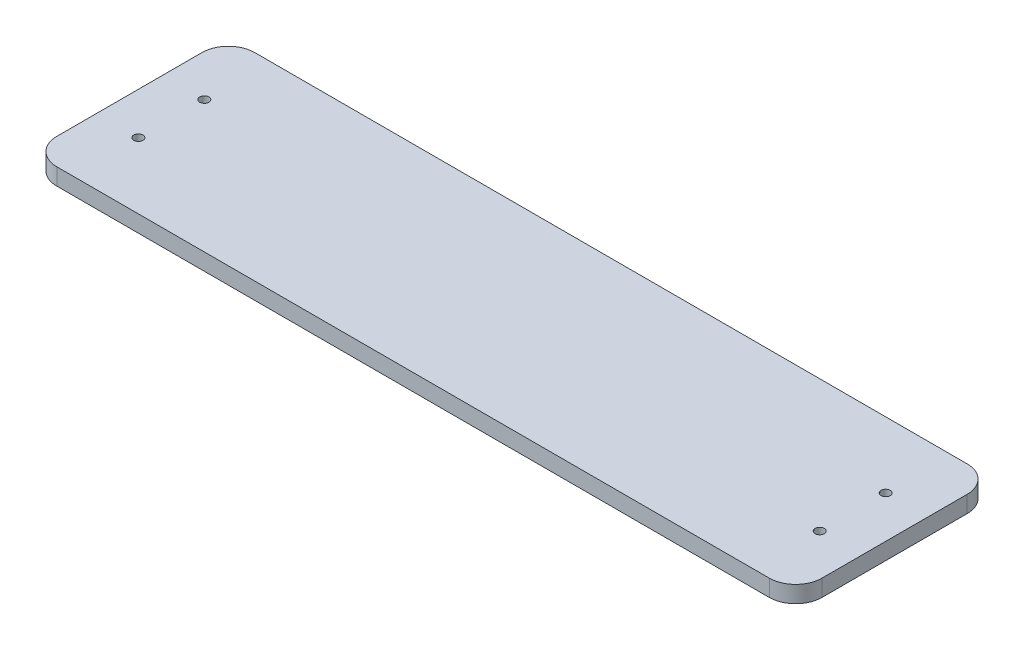
ISO-10303-21;
HEADER;
FILE_DESCRIPTION(('STEP AP214'),'2;1');
FILE_NAME('part.step','',(''),(''),'','','');
FILE_SCHEMA(('AUTOMOTIVE_DESIGN { 1 0 10303 214 1 1 1 1 }'));
ENDSEC;
DATA;
#1=APPLICATION_CONTEXT('core data for automotive mechanical design processes');
#2=APPLICATION_PROTOCOL_DEFINITION('international standard','automotive_design',2000,#1);
#3=PRODUCT_CONTEXT('',#1,'mechanical');
#4=PRODUCT('Part','Part','',(#3));
#5=PRODUCT_RELATED_PRODUCT_CATEGORY('part','',(#4));
#6=PRODUCT_DEFINITION_FORMATION('','',#4);
#7=PRODUCT_DEFINITION_CONTEXT('part definition',#1,'design');
#8=PRODUCT_DEFINITION('design','',#6,#7);
#9=PRODUCT_DEFINITION_SHAPE('','',#8);
#10=(LENGTH_UNIT() NAMED_UNIT(*) SI_UNIT(.MILLI.,.METRE.));
#11=(NAMED_UNIT(*) PLANE_ANGLE_UNIT() SI_UNIT($,.RADIAN.));
#12=(NAMED_UNIT(*) SI_UNIT($,.STERADIAN.) SOLID_ANGLE_UNIT());
#13=UNCERTAINTY_MEASURE_WITH_UNIT(LENGTH_MEASURE(1.E-05),#10,'distance_accuracy_value','');
#14=(GEOMETRIC_REPRESENTATION_CONTEXT(3) GLOBAL_UNCERTAINTY_ASSIGNED_CONTEXT((#13)) GLOBAL_UNIT_ASSIGNED_CONTEXT((#10,
#11,#12)) REPRESENTATION_CONTEXT('',''));
#15=CARTESIAN_POINT('',(0.,0.,0.));
#16=DIRECTION('',(0.,0.,1.));
#17=DIRECTION('',(1.,0.,0.));
#18=AXIS2_PLACEMENT_3D('',#15,#16,#17);
#19=CARTESIAN_POINT('',(145.,6.35,-37.5));
#20=DIRECTION('',(-1.,0.,0.));
#21=DIRECTION('',(0.,0.,1.));
#22=AXIS2_PLACEMENT_3D('',#19,#20,#21);
#23=PLANE('',#22);
#24=DIRECTION('',(0.,0.,-1.));
#25=VECTOR('',#24,1.);
#26=CARTESIAN_POINT('',(145.,0.,-37.5));
#27=LINE('',#26,#25);
#28=CARTESIAN_POINT('',(145.,0.,27.5));
#29=VERTEX_POINT('',#28);
#30=CARTESIAN_POINT('',(145.,0.,-27.5));
#31=VERTEX_POINT('',#30);
#32=EDGE_CURVE('E126',#29,#31,#27,.T.);
#33=ORIENTED_EDGE('',*,*,#32,.T.);
#34=DIRECTION('',(0.,-1.,0.));
#35=VECTOR('',#34,1.);
#36=CARTESIAN_POINT('',(145.,6.35,-27.5));
#37=LINE('',#36,#35);
#38=CARTESIAN_POINT('',(145.,6.35,-27.5));
#39=VERTEX_POINT('',#38);
#40=EDGE_CURVE('E104',#31,#39,#37,.F.);
#41=ORIENTED_EDGE('',*,*,#40,.T.);
#42=DIRECTION('',(0.,0.,-1.));
#43=VECTOR('',#42,1.);
#44=CARTESIAN_POINT('',(145.,6.35,-37.5));
#45=LINE('',#44,#43);
#46=CARTESIAN_POINT('',(145.,6.35,27.5));
#47=VERTEX_POINT('',#46);
#48=EDGE_CURVE('E136',#47,#39,#45,.T.);
#49=ORIENTED_EDGE('',*,*,#48,.F.);
#50=DIRECTION('',(0.,-1.,0.));
#51=VECTOR('',#50,1.);
#52=CARTESIAN_POINT('',(145.,6.35,27.5));
#53=LINE('',#52,#51);
#54=EDGE_CURVE('E109',#47,#29,#53,.T.);
#55=ORIENTED_EDGE('',*,*,#54,.T.);
#56=EDGE_LOOP('',(#33,#41,#49,#55));
#57=FACE_BOUND('',#56,.T.);
#58=ADVANCED_FACE('F33',(#57),#23,.F.);
#59=CARTESIAN_POINT('',(-145.,6.35,-37.5));
#60=DIRECTION('',(0.,0.,1.));
#61=DIRECTION('',(1.,0.,0.));
#62=AXIS2_PLACEMENT_3D('',#59,#60,#61);
#63=PLANE('',#62);
#64=DIRECTION('',(-1.,0.,0.));
#65=VECTOR('',#64,1.);
#66=CARTESIAN_POINT('',(-145.,6.35,-37.5));
#67=LINE('',#66,#65);
#68=CARTESIAN_POINT('',(135.,6.35,-37.5));
#69=VERTEX_POINT('',#68);
#70=CARTESIAN_POINT('',(-135.,6.35,-37.5));
#71=VERTEX_POINT('',#70);
#72=EDGE_CURVE('E119',#69,#71,#67,.T.);
#73=ORIENTED_EDGE('',*,*,#72,.F.);
#74=DIRECTION('',(0.,-1.,0.));
#75=VECTOR('',#74,1.);
#76=CARTESIAN_POINT('',(135.,6.35,-37.5));
#77=LINE('',#76,#75);
#78=CARTESIAN_POINT('',(135.,0.,-37.5));
#79=VERTEX_POINT('',#78);
#80=EDGE_CURVE('E103',#69,#79,#77,.T.);
#81=ORIENTED_EDGE('',*,*,#80,.T.);
#82=DIRECTION('',(-1.,0.,0.));
#83=VECTOR('',#82,1.);
#84=CARTESIAN_POINT('',(-145.,0.,-37.5));
#85=LINE('',#84,#83);
#86=CARTESIAN_POINT('',(-135.,0.,-37.5));
#87=VERTEX_POINT('',#86);
#88=EDGE_CURVE('E116',#79,#87,#85,.T.);
#89=ORIENTED_EDGE('',*,*,#88,.T.);
#90=DIRECTION('',(0.,-1.,0.));
#91=VECTOR('',#90,1.);
#92=CARTESIAN_POINT('',(-135.,6.35,-37.5));
#93=LINE('',#92,#91);
#94=EDGE_CURVE('E121',#87,#71,#93,.F.);
#95=ORIENTED_EDGE('',*,*,#94,.T.);
#96=EDGE_LOOP('',(#73,#81,#89,#95));
#97=FACE_BOUND('',#96,.T.);
#98=ADVANCED_FACE('F115',(#97),#63,.F.);
#99=CARTESIAN_POINT('',(-145.,6.35,-37.5));
#100=DIRECTION('',(1.,0.,0.));
#101=DIRECTION('',(0.,0.,-1.));
#102=AXIS2_PLACEMENT_3D('',#99,#100,#101);
#103=PLANE('',#102);
#104=DIRECTION('',(0.,0.,1.));
#105=VECTOR('',#104,1.);
#106=CARTESIAN_POINT('',(-145.,0.,-37.5));
#107=LINE('',#106,#105);
#108=CARTESIAN_POINT('',(-145.,0.,-27.5));
#109=VERTEX_POINT('',#108);
#110=CARTESIAN_POINT('',(-145.,0.,27.5));
#111=VERTEX_POINT('',#110);
#112=EDGE_CURVE('E125',#109,#111,#107,.T.);
#113=ORIENTED_EDGE('',*,*,#112,.T.);
#114=DIRECTION('',(0.,-1.,0.));
#115=VECTOR('',#114,1.);
#116=CARTESIAN_POINT('',(-145.,6.35,27.5));
#117=LINE('',#116,#115);
#118=CARTESIAN_POINT('',(-145.,6.35,27.5));
#119=VERTEX_POINT('',#118);
#120=EDGE_CURVE('E11',#111,#119,#117,.F.);
#121=ORIENTED_EDGE('',*,*,#120,.T.);
#122=DIRECTION('',(0.,0.,1.));
#123=VECTOR('',#122,1.);
#124=CARTESIAN_POINT('',(-145.,6.35,-37.5));
#125=LINE('',#124,#123);
#126=CARTESIAN_POINT('',(-145.,6.35,-27.5));
#127=VERTEX_POINT('',#126);
#128=EDGE_CURVE('E162',#127,#119,#125,.T.);
#129=ORIENTED_EDGE('',*,*,#128,.F.);
#130=DIRECTION('',(0.,-1.,0.));
#131=VECTOR('',#130,1.);
#132=CARTESIAN_POINT('',(-145.,6.35,-27.5));
#133=LINE('',#132,#131);
#134=EDGE_CURVE('E41',#127,#109,#133,.T.);
#135=ORIENTED_EDGE('',*,*,#134,.T.);
#136=EDGE_LOOP('',(#113,#121,#129,#135));
#137=FACE_BOUND('',#136,.T.);
#138=ADVANCED_FACE('F160',(#137),#103,.F.);
#139=CARTESIAN_POINT('',(-145.,6.35,37.5));
#140=DIRECTION('',(0.,0.,-1.));
#141=DIRECTION('',(-1.,0.,0.));
#142=AXIS2_PLACEMENT_3D('',#139,#140,#141);
#143=PLANE('',#142);
#144=DIRECTION('',(1.,0.,0.));
#145=VECTOR('',#144,1.);
#146=CARTESIAN_POINT('',(-145.,0.,37.5));
#147=LINE('',#146,#145);
#148=CARTESIAN_POINT('',(-135.,0.,37.5));
#149=VERTEX_POINT('',#148);
#150=CARTESIAN_POINT('',(135.,0.,37.5));
#151=VERTEX_POINT('',#150);
#152=EDGE_CURVE('E129',#149,#151,#147,.T.);
#153=ORIENTED_EDGE('',*,*,#152,.T.);
#154=DIRECTION('',(0.,-1.,0.));
#155=VECTOR('',#154,1.);
#156=CARTESIAN_POINT('',(135.,6.35,37.5));
#157=LINE('',#156,#155);
#158=CARTESIAN_POINT('',(135.,6.35,37.5));
#159=VERTEX_POINT('',#158);
#160=EDGE_CURVE('E48',#151,#159,#157,.F.);
#161=ORIENTED_EDGE('',*,*,#160,.T.);
#162=DIRECTION('',(1.,0.,0.));
#163=VECTOR('',#162,1.);
#164=CARTESIAN_POINT('',(-145.,6.35,37.5));
#165=LINE('',#164,#163);
#166=CARTESIAN_POINT('',(-135.,6.35,37.5));
#167=VERTEX_POINT('',#166);
#168=EDGE_CURVE('E137',#167,#159,#165,.T.);
#169=ORIENTED_EDGE('',*,*,#168,.F.);
#170=DIRECTION('',(0.,-1.,0.));
#171=VECTOR('',#170,1.);
#172=CARTESIAN_POINT('',(-135.,6.35,37.5));
#173=LINE('',#172,#171);
#174=EDGE_CURVE('E153',#167,#149,#173,.T.);
#175=ORIENTED_EDGE('',*,*,#174,.T.);
#176=EDGE_LOOP('',(#153,#161,#169,#175));
#177=FACE_BOUND('',#176,.T.);
#178=ADVANCED_FACE('F169',(#177),#143,.F.);
#179=CARTESIAN_POINT('',(0.,6.35,0.));
#180=DIRECTION('',(0.,1.,0.));
#181=DIRECTION('',(0.,0.,1.));
#182=AXIS2_PLACEMENT_3D('',#179,#180,#181);
#183=PLANE('',#182);
#184=CARTESIAN_POINT('',(-129.12,6.35,12.5));
#185=DIRECTION('',(0.,1.,0.));
#186=DIRECTION('',(0.,0.,1.));
#187=AXIS2_PLACEMENT_3D('',#184,#185,#186);
#188=CIRCLE('',#187,1.75000000000001);
#189=CARTESIAN_POINT('',(-129.12,6.35,14.25));
#190=VERTEX_POINT('',#189);
#191=EDGE_CURVE('E191',#190,#190,#188,.T.);
#192=ORIENTED_EDGE('',*,*,#191,.F.);
#193=EDGE_LOOP('',(#192));
#194=FACE_BOUND('',#193,.T.);
#195=CARTESIAN_POINT('',(129.12,6.35,12.5));
#196=DIRECTION('',(0.,1.,0.));
#197=DIRECTION('',(0.,0.,1.));
#198=AXIS2_PLACEMENT_3D('',#195,#196,#197);
#199=CIRCLE('',#198,1.75000000000001);
#200=CARTESIAN_POINT('',(129.12,6.35,14.25));
#201=VERTEX_POINT('',#200);
#202=EDGE_CURVE('E188',#201,#201,#199,.T.);
#203=ORIENTED_EDGE('',*,*,#202,.F.);
#204=EDGE_LOOP('',(#203));
#205=FACE_BOUND('',#204,.T.);
#206=CARTESIAN_POINT('',(-129.12,6.35,-12.5));
#207=DIRECTION('',(0.,1.,0.));
#208=DIRECTION('',(0.,0.,1.));
#209=AXIS2_PLACEMENT_3D('',#206,#207,#208);
#210=CIRCLE('',#209,1.75000000000001);
#211=CARTESIAN_POINT('',(-129.12,6.35,-10.75));
#212=VERTEX_POINT('',#211);
#213=EDGE_CURVE('E182',#212,#212,#210,.T.);
#214=ORIENTED_EDGE('',*,*,#213,.F.);
#215=EDGE_LOOP('',(#214));
#216=FACE_BOUND('',#215,.T.);
#217=CARTESIAN_POINT('',(129.12,6.35,-12.5));
#218=DIRECTION('',(0.,1.,0.));
#219=DIRECTION('',(0.,0.,1.));
#220=AXIS2_PLACEMENT_3D('',#217,#218,#219);
#221=CIRCLE('',#220,1.75000000000001);
#222=CARTESIAN_POINT('',(129.12,6.35,-10.75));
#223=VERTEX_POINT('',#222);
#224=EDGE_CURVE('E176',#223,#223,#221,.T.);
#225=ORIENTED_EDGE('',*,*,#224,.F.);
#226=EDGE_LOOP('',(#225));
#227=FACE_BOUND('',#226,.T.);
#228=ORIENTED_EDGE('',*,*,#48,.T.);
#229=CARTESIAN_POINT('',(135.,6.35,-27.5));
#230=DIRECTION('',(0.,1.,0.));
#231=DIRECTION('',(0.,0.,1.));
#232=AXIS2_PLACEMENT_3D('',#229,#230,#231);
#233=CIRCLE('',#232,10.);
#234=EDGE_CURVE('E151',#39,#69,#233,.T.);
#235=ORIENTED_EDGE('',*,*,#234,.T.);
#236=ORIENTED_EDGE('',*,*,#72,.T.);
#237=CARTESIAN_POINT('',(-135.,6.35,-27.5));
#238=DIRECTION('',(0.,1.,0.));
#239=DIRECTION('',(0.,0.,1.));
#240=AXIS2_PLACEMENT_3D('',#237,#238,#239);
#241=CIRCLE('',#240,10.);
#242=EDGE_CURVE('E146',#71,#127,#241,.T.);
#243=ORIENTED_EDGE('',*,*,#242,.T.);
#244=ORIENTED_EDGE('',*,*,#128,.T.);
#245=CARTESIAN_POINT('',(-135.,6.35,27.5));
#246=DIRECTION('',(0.,1.,0.));
#247=DIRECTION('',(0.,0.,1.));
#248=AXIS2_PLACEMENT_3D('',#245,#246,#247);
#249=CIRCLE('',#248,10.);
#250=EDGE_CURVE('E55',#119,#167,#249,.T.);
#251=ORIENTED_EDGE('',*,*,#250,.T.);
#252=ORIENTED_EDGE('',*,*,#168,.T.);
#253=CARTESIAN_POINT('',(135.,6.35,27.5));
#254=DIRECTION('',(0.,1.,0.));
#255=DIRECTION('',(0.,0.,1.));
#256=AXIS2_PLACEMENT_3D('',#253,#254,#255);
#257=CIRCLE('',#256,10.);
#258=EDGE_CURVE('E149',#159,#47,#257,.T.);
#259=ORIENTED_EDGE('',*,*,#258,.T.);
#260=EDGE_LOOP('',(#228,#235,#236,#243,#244,#251,#252,#259));
#261=FACE_BOUND('',#260,.T.);
#262=ADVANCED_FACE('F209',(#194,#205,#216,#227,#261),#183,.T.);
#263=CARTESIAN_POINT('',(0.,0.,0.));
#264=DIRECTION('',(0.,1.,0.));
#265=DIRECTION('',(0.,0.,1.));
#266=AXIS2_PLACEMENT_3D('',#263,#264,#265);
#267=PLANE('',#266);
#268=CARTESIAN_POINT('',(-129.12,0.,12.5));
#269=DIRECTION('',(0.,1.,0.));
#270=DIRECTION('',(0.,0.,1.));
#271=AXIS2_PLACEMENT_3D('',#268,#269,#270);
#272=CIRCLE('',#271,1.75000000000001);
#273=CARTESIAN_POINT('',(-129.12,0.,14.25));
#274=VERTEX_POINT('',#273);
#275=EDGE_CURVE('E196',#274,#274,#272,.T.);
#276=ORIENTED_EDGE('',*,*,#275,.T.);
#277=EDGE_LOOP('',(#276));
#278=FACE_BOUND('',#277,.T.);
#279=CARTESIAN_POINT('',(129.12,0.,12.5));
#280=DIRECTION('',(0.,1.,0.));
#281=DIRECTION('',(0.,0.,1.));
#282=AXIS2_PLACEMENT_3D('',#279,#280,#281);
#283=CIRCLE('',#282,1.75000000000001);
#284=CARTESIAN_POINT('',(129.12,0.,14.25));
#285=VERTEX_POINT('',#284);
#286=EDGE_CURVE('E185',#285,#285,#283,.T.);
#287=ORIENTED_EDGE('',*,*,#286,.T.);
#288=EDGE_LOOP('',(#287));
#289=FACE_BOUND('',#288,.T.);
#290=CARTESIAN_POINT('',(-129.12,0.,-12.5));
#291=DIRECTION('',(0.,1.,0.));
#292=DIRECTION('',(0.,0.,1.));
#293=AXIS2_PLACEMENT_3D('',#290,#291,#292);
#294=CIRCLE('',#293,1.75000000000001);
#295=CARTESIAN_POINT('',(-129.12,0.,-10.75));
#296=VERTEX_POINT('',#295);
#297=EDGE_CURVE('E179',#296,#296,#294,.T.);
#298=ORIENTED_EDGE('',*,*,#297,.T.);
#299=EDGE_LOOP('',(#298));
#300=FACE_BOUND('',#299,.T.);
#301=CARTESIAN_POINT('',(129.12,0.,-12.5));
#302=DIRECTION('',(0.,1.,0.));
#303=DIRECTION('',(0.,0.,1.));
#304=AXIS2_PLACEMENT_3D('',#301,#302,#303);
#305=CIRCLE('',#304,1.75000000000001);
#306=CARTESIAN_POINT('',(129.12,0.,-10.75));
#307=VERTEX_POINT('',#306);
#308=EDGE_CURVE('E131',#307,#307,#305,.T.);
#309=ORIENTED_EDGE('',*,*,#308,.T.);
#310=EDGE_LOOP('',(#309));
#311=FACE_BOUND('',#310,.T.);
#312=ORIENTED_EDGE('',*,*,#88,.F.);
#313=CARTESIAN_POINT('',(135.,0.,-27.5));
#314=DIRECTION('',(0.,1.,0.));
#315=DIRECTION('',(0.,0.,1.));
#316=AXIS2_PLACEMENT_3D('',#313,#314,#315);
#317=CIRCLE('',#316,10.);
#318=EDGE_CURVE('E99',#79,#31,#317,.F.);
#319=ORIENTED_EDGE('',*,*,#318,.T.);
#320=ORIENTED_EDGE('',*,*,#32,.F.);
#321=CARTESIAN_POINT('',(135.,0.,27.5));
#322=DIRECTION('',(0.,1.,0.));
#323=DIRECTION('',(0.,0.,1.));
#324=AXIS2_PLACEMENT_3D('',#321,#322,#323);
#325=CIRCLE('',#324,10.);
#326=EDGE_CURVE('E110',#29,#151,#325,.F.);
#327=ORIENTED_EDGE('',*,*,#326,.T.);
#328=ORIENTED_EDGE('',*,*,#152,.F.);
#329=CARTESIAN_POINT('',(-135.,0.,27.5));
#330=DIRECTION('',(0.,1.,0.));
#331=DIRECTION('',(0.,0.,1.));
#332=AXIS2_PLACEMENT_3D('',#329,#330,#331);
#333=CIRCLE('',#332,10.);
#334=EDGE_CURVE('E140',#149,#111,#333,.F.);
#335=ORIENTED_EDGE('',*,*,#334,.T.);
#336=ORIENTED_EDGE('',*,*,#112,.F.);
#337=CARTESIAN_POINT('',(-135.,0.,-27.5));
#338=DIRECTION('',(0.,1.,0.));
#339=DIRECTION('',(0.,0.,1.));
#340=AXIS2_PLACEMENT_3D('',#337,#338,#339);
#341=CIRCLE('',#340,10.);
#342=EDGE_CURVE('E120',#109,#87,#341,.F.);
#343=ORIENTED_EDGE('',*,*,#342,.T.);
#344=EDGE_LOOP('',(#312,#319,#320,#327,#328,#335,#336,#343));
#345=FACE_BOUND('',#344,.T.);
#346=ADVANCED_FACE('F123',(#278,#289,#300,#311,#345),#267,.F.);
#347=CARTESIAN_POINT('',(129.12,0.,-12.5));
#348=DIRECTION('',(0.,1.,0.));
#349=DIRECTION('',(0.,0.,1.));
#350=AXIS2_PLACEMENT_3D('',#347,#348,#349);
#351=CYLINDRICAL_SURFACE('',#350,1.75000000000001);
#352=ORIENTED_EDGE('',*,*,#308,.F.);
#353=EDGE_LOOP('',(#352));
#354=FACE_BOUND('',#353,.T.);
#355=ORIENTED_EDGE('',*,*,#224,.T.);
#356=EDGE_LOOP('',(#355));
#357=FACE_BOUND('',#356,.T.);
#358=ADVANCED_FACE('F229',(#354,#357),#351,.F.);
#359=CARTESIAN_POINT('',(135.,6.35,-27.5));
#360=DIRECTION('',(0.,-1.,0.));
#361=DIRECTION('',(0.,0.,-1.));
#362=AXIS2_PLACEMENT_3D('',#359,#360,#361);
#363=CYLINDRICAL_SURFACE('',#362,10.);
#364=ORIENTED_EDGE('',*,*,#234,.F.);
#365=ORIENTED_EDGE('',*,*,#40,.F.);
#366=ORIENTED_EDGE('',*,*,#318,.F.);
#367=ORIENTED_EDGE('',*,*,#80,.F.);
#368=EDGE_LOOP('',(#364,#365,#366,#367));
#369=FACE_BOUND('',#368,.T.);
#370=ADVANCED_FACE('F102',(#369),#363,.T.);
#371=CARTESIAN_POINT('',(135.,6.35,27.5));
#372=DIRECTION('',(0.,-1.,0.));
#373=DIRECTION('',(0.,0.,-1.));
#374=AXIS2_PLACEMENT_3D('',#371,#372,#373);
#375=CYLINDRICAL_SURFACE('',#374,10.);
#376=ORIENTED_EDGE('',*,*,#258,.F.);
#377=ORIENTED_EDGE('',*,*,#160,.F.);
#378=ORIENTED_EDGE('',*,*,#326,.F.);
#379=ORIENTED_EDGE('',*,*,#54,.F.);
#380=EDGE_LOOP('',(#376,#377,#378,#379));
#381=FACE_BOUND('',#380,.T.);
#382=ADVANCED_FACE('F222',(#381),#375,.T.);
#383=CARTESIAN_POINT('',(-135.,6.35,27.5));
#384=DIRECTION('',(0.,-1.,0.));
#385=DIRECTION('',(0.,0.,-1.));
#386=AXIS2_PLACEMENT_3D('',#383,#384,#385);
#387=CYLINDRICAL_SURFACE('',#386,10.);
#388=ORIENTED_EDGE('',*,*,#250,.F.);
#389=ORIENTED_EDGE('',*,*,#120,.F.);
#390=ORIENTED_EDGE('',*,*,#334,.F.);
#391=ORIENTED_EDGE('',*,*,#174,.F.);
#392=EDGE_LOOP('',(#388,#389,#390,#391));
#393=FACE_BOUND('',#392,.T.);
#394=ADVANCED_FACE('F168',(#393),#387,.T.);
#395=CARTESIAN_POINT('',(-135.,6.35,-27.5));
#396=DIRECTION('',(0.,-1.,0.));
#397=DIRECTION('',(0.,0.,-1.));
#398=AXIS2_PLACEMENT_3D('',#395,#396,#397);
#399=CYLINDRICAL_SURFACE('',#398,10.);
#400=ORIENTED_EDGE('',*,*,#242,.F.);
#401=ORIENTED_EDGE('',*,*,#94,.F.);
#402=ORIENTED_EDGE('',*,*,#342,.F.);
#403=ORIENTED_EDGE('',*,*,#134,.F.);
#404=EDGE_LOOP('',(#400,#401,#402,#403));
#405=FACE_BOUND('',#404,.T.);
#406=ADVANCED_FACE('F35',(#405),#399,.T.);
#407=CARTESIAN_POINT('',(-129.12,0.,-12.5));
#408=DIRECTION('',(0.,1.,0.));
#409=DIRECTION('',(0.,0.,1.));
#410=AXIS2_PLACEMENT_3D('',#407,#408,#409);
#411=CYLINDRICAL_SURFACE('',#410,1.75000000000001);
#412=ORIENTED_EDGE('',*,*,#297,.F.);
#413=EDGE_LOOP('',(#412));
#414=FACE_BOUND('',#413,.T.);
#415=ORIENTED_EDGE('',*,*,#213,.T.);
#416=EDGE_LOOP('',(#415));
#417=FACE_BOUND('',#416,.T.);
#418=ADVANCED_FACE('F247',(#414,#417),#411,.F.);
#419=CARTESIAN_POINT('',(129.12,0.,12.5));
#420=DIRECTION('',(0.,1.,0.));
#421=DIRECTION('',(0.,0.,1.));
#422=AXIS2_PLACEMENT_3D('',#419,#420,#421);
#423=CYLINDRICAL_SURFACE('',#422,1.75000000000001);
#424=ORIENTED_EDGE('',*,*,#286,.F.);
#425=EDGE_LOOP('',(#424));
#426=FACE_BOUND('',#425,.T.);
#427=ORIENTED_EDGE('',*,*,#202,.T.);
#428=EDGE_LOOP('',(#427));
#429=FACE_BOUND('',#428,.T.);
#430=ADVANCED_FACE('F205',(#426,#429),#423,.F.);
#431=CARTESIAN_POINT('',(-129.12,0.,12.5));
#432=DIRECTION('',(0.,1.,0.));
#433=DIRECTION('',(0.,0.,1.));
#434=AXIS2_PLACEMENT_3D('',#431,#432,#433);
#435=CYLINDRICAL_SURFACE('',#434,1.75000000000001);
#436=ORIENTED_EDGE('',*,*,#275,.F.);
#437=EDGE_LOOP('',(#436));
#438=FACE_BOUND('',#437,.T.);
#439=ORIENTED_EDGE('',*,*,#191,.T.);
#440=EDGE_LOOP('',(#439));
#441=FACE_BOUND('',#440,.T.);
#442=ADVANCED_FACE('F202',(#438,#441),#435,.F.);
#443=CLOSED_SHELL('',(#58,#98,#138,#178,#262,#346,#358,#370,#382,#394,#406,#418,#430,#442));
#444=MANIFOLD_SOLID_BREP('B2',#443);
#445=ADVANCED_BREP_SHAPE_REPRESENTATION('',(#18,#444),#14);
#446=SHAPE_DEFINITION_REPRESENTATION(#9,#445);
ENDSEC;
END-ISO-10303-21;
